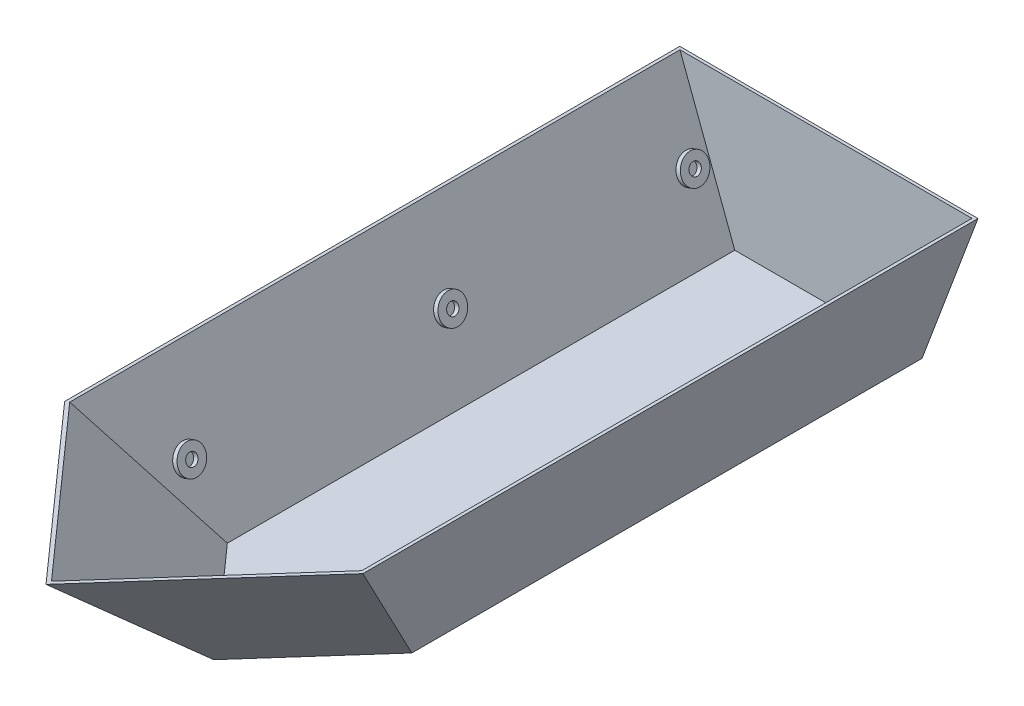
ISO-10303-21;
HEADER;
FILE_DESCRIPTION(('STEP AP214'),'2;1');
FILE_NAME('part.step','',(''),(''),'','','');
FILE_SCHEMA(('AUTOMOTIVE_DESIGN { 1 0 10303 214 1 1 1 1 }'));
ENDSEC;
DATA;
#1=APPLICATION_CONTEXT('core data for automotive mechanical design processes');
#2=APPLICATION_PROTOCOL_DEFINITION('international standard','automotive_design',2000,#1);
#3=PRODUCT_CONTEXT('',#1,'mechanical');
#4=PRODUCT('Part','Part','',(#3));
#5=PRODUCT_RELATED_PRODUCT_CATEGORY('part','',(#4));
#6=PRODUCT_DEFINITION_FORMATION('','',#4);
#7=PRODUCT_DEFINITION_CONTEXT('part definition',#1,'design');
#8=PRODUCT_DEFINITION('design','',#6,#7);
#9=PRODUCT_DEFINITION_SHAPE('','',#8);
#10=(LENGTH_UNIT() NAMED_UNIT(*) SI_UNIT(.MILLI.,.METRE.));
#11=(NAMED_UNIT(*) PLANE_ANGLE_UNIT() SI_UNIT($,.RADIAN.));
#12=(NAMED_UNIT(*) SI_UNIT($,.STERADIAN.) SOLID_ANGLE_UNIT());
#13=UNCERTAINTY_MEASURE_WITH_UNIT(LENGTH_MEASURE(1.E-05),#10,'distance_accuracy_value','');
#14=(GEOMETRIC_REPRESENTATION_CONTEXT(3) GLOBAL_UNCERTAINTY_ASSIGNED_CONTEXT((#13)) GLOBAL_UNIT_ASSIGNED_CONTEXT((#10,
#11,#12)) REPRESENTATION_CONTEXT('',''));
#15=CARTESIAN_POINT('',(0.,0.,0.));
#16=DIRECTION('',(0.,0.,1.));
#17=DIRECTION('',(1.,0.,0.));
#18=AXIS2_PLACEMENT_3D('',#15,#16,#17);
#19=CARTESIAN_POINT('',(660.4,406.4,2133.6));
#20=DIRECTION('',(0.,-1.,0.));
#21=DIRECTION('',(0.,0.,-1.));
#22=AXIS2_PLACEMENT_3D('',#19,#20,#21);
#23=PLANE('',#22);
#24=DIRECTION('',(0.66436383882992,0.,0.74740931868366));
#25=VECTOR('',#24,1.);
#26=CARTESIAN_POINT('',(-1501.75378137035,406.4,158.376995958358));
#27=LINE('',#26,#25);
#28=CARTESIAN_POINT('',(-152.4,406.4,1676.4));
#29=VERTEX_POINT('',#28);
#30=CARTESIAN_POINT('',(253.999999999999,406.4,2133.6));
#31=VERTEX_POINT('',#30);
#32=EDGE_CURVE('E170',#29,#31,#27,.T.);
#33=ORIENTED_EDGE('',*,*,#32,.T.);
#34=DIRECTION('',(-0.66436383882992,0.,0.74740931868366));
#35=VECTOR('',#34,1.);
#36=CARTESIAN_POINT('',(2009.75378137035,406.4,158.376995958358));
#37=LINE('',#36,#35);
#38=CARTESIAN_POINT('',(660.4,406.4,1676.4));
#39=VERTEX_POINT('',#38);
#40=EDGE_CURVE('E137',#39,#31,#37,.T.);
#41=ORIENTED_EDGE('',*,*,#40,.F.);
#42=DIRECTION('',(0.,0.,-1.));
#43=VECTOR('',#42,1.);
#44=CARTESIAN_POINT('',(660.4,406.4,2133.6));
#45=LINE('',#44,#43);
#46=CARTESIAN_POINT('',(660.4,406.4,0.));
#47=VERTEX_POINT('',#46);
#48=EDGE_CURVE('E186',#39,#47,#45,.T.);
#49=ORIENTED_EDGE('',*,*,#48,.T.);
#50=DIRECTION('',(-1.,0.,0.));
#51=VECTOR('',#50,1.);
#52=CARTESIAN_POINT('',(660.4,406.4,0.));
#53=LINE('',#52,#51);
#54=CARTESIAN_POINT('',(-152.4,406.4,0.));
#55=VERTEX_POINT('',#54);
#56=EDGE_CURVE('E183',#47,#55,#53,.T.);
#57=ORIENTED_EDGE('',*,*,#56,.T.);
#58=DIRECTION('',(0.,0.,-1.));
#59=VECTOR('',#58,1.);
#60=CARTESIAN_POINT('',(-152.4,406.4,2133.6));
#61=LINE('',#60,#59);
#62=EDGE_CURVE('E57',#29,#55,#61,.T.);
#63=ORIENTED_EDGE('',*,*,#62,.F.);
#64=EDGE_LOOP('',(#33,#41,#49,#57,#63));
#65=FACE_BOUND('',#64,.T.);
#66=DIRECTION('',(0.66436383882992,0.,0.74740931868366));
#67=VECTOR('',#66,1.);
#68=CARTESIAN_POINT('',(-1494.34729095635,406.4,151.793448923691));
#69=LINE('',#68,#67);
#70=CARTESIAN_POINT('',(-143.922746283943,406.4,1671.02106168015));
#71=VERTEX_POINT('',#70);
#72=CARTESIAN_POINT('',(254.,406.4,2118.68415124958));
#73=VERTEX_POINT('',#72);
#74=EDGE_CURVE('E122',#71,#73,#69,.T.);
#75=ORIENTED_EDGE('',*,*,#74,.F.);
#76=DIRECTION('',(0.,0.,-1.));
#77=VECTOR('',#76,1.);
#78=CARTESIAN_POINT('',(-143.922746283943,406.4,2133.6));
#79=LINE('',#78,#77);
#80=CARTESIAN_POINT('',(-143.922746283943,406.4,7.9375));
#81=VERTEX_POINT('',#80);
#82=EDGE_CURVE('E118',#71,#81,#79,.T.);
#83=ORIENTED_EDGE('',*,*,#82,.T.);
#84=DIRECTION('',(-1.,0.,0.));
#85=VECTOR('',#84,1.);
#86=CARTESIAN_POINT('',(660.4,406.4,7.93750000000015));
#87=LINE('',#86,#85);
#88=CARTESIAN_POINT('',(651.922746283943,406.4,7.9375));
#89=VERTEX_POINT('',#88);
#90=EDGE_CURVE('E151',#89,#81,#87,.T.);
#91=ORIENTED_EDGE('',*,*,#90,.F.);
#92=DIRECTION('',(0.,0.,-1.));
#93=VECTOR('',#92,1.);
#94=CARTESIAN_POINT('',(651.922746283943,406.4,2133.6));
#95=LINE('',#94,#93);
#96=CARTESIAN_POINT('',(651.922746283943,406.4,1671.02106168015));
#97=VERTEX_POINT('',#96);
#98=EDGE_CURVE('E139',#97,#89,#95,.T.);
#99=ORIENTED_EDGE('',*,*,#98,.F.);
#100=DIRECTION('',(-0.66436383882992,0.,0.74740931868366));
#101=VECTOR('',#100,1.);
#102=CARTESIAN_POINT('',(2002.34729095635,406.4,151.793448923691));
#103=LINE('',#102,#101);
#104=EDGE_CURVE('E144',#97,#73,#103,.T.);
#105=ORIENTED_EDGE('',*,*,#104,.T.);
#106=EDGE_LOOP('',(#75,#83,#91,#99,#105));
#107=FACE_BOUND('',#106,.T.);
#108=ADVANCED_FACE('F34',(#65,#107),#23,.F.);
#109=CARTESIAN_POINT('',(-152.4,406.4,2133.6));
#110=DIRECTION('',(0.936329177569045,0.351123441588392,0.));
#111=DIRECTION('',(-0.351123441588392,0.936329177569045,0.));
#112=AXIS2_PLACEMENT_3D('',#109,#110,#111);
#113=PLANE('',#112);
#114=DIRECTION('',(0.293272331791282,-0.78205955144342,-0.549885622108654));
#115=VECTOR('',#114,1.);
#116=CARTESIAN_POINT('',(-226.13092429446,603.015798118561,1814.64548305211));
#117=LINE('',#116,#115);
#118=CARTESIAN_POINT('',(2.22044604925031E-13,0.,1390.65));
#119=VERTEX_POINT('',#118);
#120=EDGE_CURVE('E173',#29,#119,#117,.T.);
#121=ORIENTED_EDGE('',*,*,#120,.F.);
#122=ORIENTED_EDGE('',*,*,#62,.T.);
#123=DIRECTION('',(0.351123441588392,-0.936329177569045,0.));
#124=VECTOR('',#123,1.);
#125=CARTESIAN_POINT('',(-152.4,406.4,0.));
#126=LINE('',#125,#124);
#127=CARTESIAN_POINT('',(0.,0.,0.));
#128=VERTEX_POINT('',#127);
#129=EDGE_CURVE('E175',#55,#128,#126,.T.);
#130=ORIENTED_EDGE('',*,*,#129,.T.);
#131=DIRECTION('',(0.,0.,-1.));
#132=VECTOR('',#131,1.);
#133=CARTESIAN_POINT('',(0.,0.,2133.6));
#134=LINE('',#133,#132);
#135=EDGE_CURVE('E190',#119,#128,#134,.T.);
#136=ORIENTED_EDGE('',*,*,#135,.F.);
#137=EDGE_LOOP('',(#121,#122,#130,#136));
#138=FACE_BOUND('',#137,.T.);
#139=ADVANCED_FACE('F36',(#138),#113,.F.);
#140=CARTESIAN_POINT('',(0.,0.,2133.6));
#141=DIRECTION('',(0.,1.,0.));
#142=DIRECTION('',(0.,0.,1.));
#143=AXIS2_PLACEMENT_3D('',#140,#141,#142);
#144=PLANE('',#143);
#145=DIRECTION('',(0.,0.,-1.));
#146=VECTOR('',#145,1.);
#147=CARTESIAN_POINT('',(508.,0.,2133.6));
#148=LINE('',#147,#146);
#149=CARTESIAN_POINT('',(508.,0.,1390.65));
#150=VERTEX_POINT('',#149);
#151=CARTESIAN_POINT('',(508.,0.,0.));
#152=VERTEX_POINT('',#151);
#153=EDGE_CURVE('E188',#150,#152,#148,.T.);
#154=ORIENTED_EDGE('',*,*,#153,.F.);
#155=DIRECTION('',(-0.66436383882992,0.,0.74740931868366));
#156=VECTOR('',#155,1.);
#157=CARTESIAN_POINT('',(2009.75378137035,0.,-298.823004041642));
#158=LINE('',#157,#156);
#159=CARTESIAN_POINT('',(254.,0.,1676.4));
#160=VERTEX_POINT('',#159);
#161=EDGE_CURVE('E161',#150,#160,#158,.T.);
#162=ORIENTED_EDGE('',*,*,#161,.T.);
#163=DIRECTION('',(0.66436383882992,0.,0.74740931868366));
#164=VECTOR('',#163,1.);
#165=CARTESIAN_POINT('',(-1501.75378137035,0.,-298.823004041642));
#166=LINE('',#165,#164);
#167=EDGE_CURVE('E167',#119,#160,#166,.T.);
#168=ORIENTED_EDGE('',*,*,#167,.F.);
#169=ORIENTED_EDGE('',*,*,#135,.T.);
#170=DIRECTION('',(1.,0.,0.));
#171=VECTOR('',#170,1.);
#172=CARTESIAN_POINT('',(0.,0.,0.));
#173=LINE('',#172,#171);
#174=EDGE_CURVE('E177',#128,#152,#173,.T.);
#175=ORIENTED_EDGE('',*,*,#174,.T.);
#176=EDGE_LOOP('',(#154,#162,#168,#169,#175));
#177=FACE_BOUND('',#176,.T.);
#178=ADVANCED_FACE('F246',(#177),#144,.F.);
#179=CARTESIAN_POINT('',(508.,0.,2133.6));
#180=DIRECTION('',(-0.936329177569045,0.351123441588392,0.));
#181=DIRECTION('',(-0.351123441588392,-0.936329177569045,0.));
#182=AXIS2_PLACEMENT_3D('',#179,#180,#181);
#183=PLANE('',#182);
#184=ORIENTED_EDGE('',*,*,#48,.F.);
#185=DIRECTION('',(-0.293272331791282,-0.78205955144342,-0.549885622108654));
#186=VECTOR('',#185,1.);
#187=CARTESIAN_POINT('',(627.812751978498,319.500671942661,1615.29890995968));
#188=LINE('',#187,#186);
#189=EDGE_CURVE('E164',#39,#150,#188,.T.);
#190=ORIENTED_EDGE('',*,*,#189,.T.);
#191=ORIENTED_EDGE('',*,*,#153,.T.);
#192=DIRECTION('',(0.351123441588392,0.936329177569045,0.));
#193=VECTOR('',#192,1.);
#194=CARTESIAN_POINT('',(508.,0.,0.));
#195=LINE('',#194,#193);
#196=EDGE_CURVE('E180',#152,#47,#195,.T.);
#197=ORIENTED_EDGE('',*,*,#196,.T.);
#198=EDGE_LOOP('',(#184,#190,#191,#197));
#199=FACE_BOUND('',#198,.T.);
#200=ADVANCED_FACE('F252',(#199),#183,.F.);
#201=CARTESIAN_POINT('',(0.,0.,0.));
#202=DIRECTION('',(0.,0.,1.));
#203=DIRECTION('',(1.,0.,0.));
#204=AXIS2_PLACEMENT_3D('',#201,#202,#203);
#205=PLANE('',#204);
#206=ORIENTED_EDGE('',*,*,#129,.F.);
#207=ORIENTED_EDGE('',*,*,#56,.F.);
#208=ORIENTED_EDGE('',*,*,#196,.F.);
#209=ORIENTED_EDGE('',*,*,#174,.F.);
#210=EDGE_LOOP('',(#206,#207,#208,#209));
#211=FACE_BOUND('',#210,.T.);
#212=ADVANCED_FACE('F250',(#211),#205,.F.);
#213=CARTESIAN_POINT('',(-1501.75378137035,406.4,158.376995958358));
#214=DIRECTION('',(-0.598671094713965,-0.598671094713965,0.532152084190192));
#215=DIRECTION('',(0.707106781186547,-0.707106781186548,0.));
#216=AXIS2_PLACEMENT_3D('',#213,#214,#215);
#217=PLANE('',#216);
#218=DIRECTION('',(0.,-0.66436383882992,-0.747409318683659));
#219=VECTOR('',#218,1.);
#220=CARTESIAN_POINT('',(254.,-574.400388213781,1030.1995632595));
#221=LINE('',#220,#219);
#222=EDGE_CURVE('E192',#31,#160,#221,.T.);
#223=ORIENTED_EDGE('',*,*,#222,.F.);
#224=ORIENTED_EDGE('',*,*,#32,.F.);
#225=ORIENTED_EDGE('',*,*,#120,.T.);
#226=ORIENTED_EDGE('',*,*,#167,.T.);
#227=EDGE_LOOP('',(#223,#224,#225,#226));
#228=FACE_BOUND('',#227,.T.);
#229=ADVANCED_FACE('F269',(#228),#217,.T.);
#230=CARTESIAN_POINT('',(2009.75378137035,406.4,158.376995958358));
#231=DIRECTION('',(-0.598671094713965,0.598671094713965,-0.532152084190192));
#232=DIRECTION('',(-0.707106781186547,-0.707106781186548,0.));
#233=AXIS2_PLACEMENT_3D('',#230,#231,#232);
#234=PLANE('',#233);
#235=ORIENTED_EDGE('',*,*,#40,.T.);
#236=ORIENTED_EDGE('',*,*,#222,.T.);
#237=ORIENTED_EDGE('',*,*,#161,.F.);
#238=ORIENTED_EDGE('',*,*,#189,.F.);
#239=EDGE_LOOP('',(#235,#236,#237,#238));
#240=FACE_BOUND('',#239,.T.);
#241=ADVANCED_FACE('F212',(#240),#234,.F.);
#242=CARTESIAN_POINT('',(-144.967887153046,409.187042317608,2133.6));
#243=DIRECTION('',(0.936329177569045,0.351123441588392,0.));
#244=DIRECTION('',(-0.351123441588392,0.936329177569045,0.));
#245=AXIS2_PLACEMENT_3D('',#242,#243,#244);
#246=PLANE('',#245);
#247=CARTESIAN_POINT('',(-63.6559275368364,192.355150007716,1430.3375));
#248=DIRECTION('',(0.936329177569045,0.351123441588392,0.));
#249=DIRECTION('',(-0.351123441588392,0.936329177569045,0.));
#250=AXIS2_PLACEMENT_3D('',#247,#248,#249);
#251=CIRCLE('',#250,38.1000000000001);
#252=CARTESIAN_POINT('',(-77.0337306613541,228.029291673097,1430.3375));
#253=VERTEX_POINT('',#252);
#254=EDGE_CURVE('E11',#253,#253,#251,.T.);
#255=ORIENTED_EDGE('',*,*,#254,.F.);
#256=EDGE_LOOP('',(#255));
#257=FACE_BOUND('',#256,.T.);
#258=CARTESIAN_POINT('',(-63.6559275368364,192.355150007716,719.1375));
#259=DIRECTION('',(0.936329177569045,0.351123441588392,0.));
#260=DIRECTION('',(-0.351123441588392,0.936329177569045,0.));
#261=AXIS2_PLACEMENT_3D('',#258,#259,#260);
#262=CIRCLE('',#261,38.1);
#263=CARTESIAN_POINT('',(-77.0337306613541,228.029291673097,719.1375));
#264=VERTEX_POINT('',#263);
#265=EDGE_CURVE('E42',#264,#264,#262,.T.);
#266=ORIENTED_EDGE('',*,*,#265,.F.);
#267=EDGE_LOOP('',(#266));
#268=FACE_BOUND('',#267,.T.);
#269=CARTESIAN_POINT('',(-63.6559275368364,192.355150007716,58.7375));
#270=DIRECTION('',(0.936329177569045,0.351123441588392,0.));
#271=DIRECTION('',(-0.351123441588392,0.936329177569045,0.));
#272=AXIS2_PLACEMENT_3D('',#269,#270,#271);
#273=CIRCLE('',#272,38.1);
#274=CARTESIAN_POINT('',(-77.0337306613541,228.029291673097,58.7375));
#275=VERTEX_POINT('',#274);
#276=EDGE_CURVE('E203',#275,#275,#273,.T.);
#277=ORIENTED_EDGE('',*,*,#276,.F.);
#278=EDGE_LOOP('',(#277));
#279=FACE_BOUND('',#278,.T.);
#280=DIRECTION('',(0.293272331791282,-0.78205955144342,-0.549885622108654));
#281=VECTOR('',#280,1.);
#282=CARTESIAN_POINT('',(-219.25022896662,607.273287153806,1812.26009171017));
#283=LINE('',#282,#281);
#284=CARTESIAN_POINT('',(5.50069121605727,7.9375,1390.85211636765));
#285=VERTEX_POINT('',#284);
#286=EDGE_CURVE('E111',#71,#285,#283,.T.);
#287=ORIENTED_EDGE('',*,*,#286,.T.);
#288=DIRECTION('',(0.,0.,-1.));
#289=VECTOR('',#288,1.);
#290=CARTESIAN_POINT('',(5.50069121605727,7.9375,2133.6));
#291=LINE('',#290,#289);
#292=CARTESIAN_POINT('',(5.50069121605725,7.9375,7.9375));
#293=VERTEX_POINT('',#292);
#294=EDGE_CURVE('E115',#285,#293,#291,.T.);
#295=ORIENTED_EDGE('',*,*,#294,.T.);
#296=DIRECTION('',(0.351123441588392,-0.936329177569045,0.));
#297=VECTOR('',#296,1.);
#298=CARTESIAN_POINT('',(-144.967887153046,409.187042317608,7.93750000000015));
#299=LINE('',#298,#297);
#300=EDGE_CURVE('E49',#81,#293,#299,.T.);
#301=ORIENTED_EDGE('',*,*,#300,.F.);
#302=ORIENTED_EDGE('',*,*,#82,.F.);
#303=EDGE_LOOP('',(#287,#295,#301,#302));
#304=FACE_BOUND('',#303,.T.);
#305=ADVANCED_FACE('F113',(#257,#268,#279,#304),#246,.T.);
#306=CARTESIAN_POINT('',(0.,7.9375,2133.6));
#307=DIRECTION('',(0.,1.,0.));
#308=DIRECTION('',(0.,0.,1.));
#309=AXIS2_PLACEMENT_3D('',#306,#307,#308);
#310=PLANE('',#309);
#311=DIRECTION('',(0.,0.,-1.));
#312=VECTOR('',#311,1.);
#313=CARTESIAN_POINT('',(502.499308783943,7.9375,2133.6));
#314=LINE('',#313,#312);
#315=CARTESIAN_POINT('',(502.499308783943,7.9375,1390.85211636765));
#316=VERTEX_POINT('',#315);
#317=CARTESIAN_POINT('',(502.499308783943,7.9375,7.9375));
#318=VERTEX_POINT('',#317);
#319=EDGE_CURVE('E135',#316,#318,#314,.T.);
#320=ORIENTED_EDGE('',*,*,#319,.T.);
#321=DIRECTION('',(1.,0.,0.));
#322=VECTOR('',#321,1.);
#323=CARTESIAN_POINT('',(0.,7.9375,7.93750000000015));
#324=LINE('',#323,#322);
#325=EDGE_CURVE('E134',#293,#318,#324,.T.);
#326=ORIENTED_EDGE('',*,*,#325,.F.);
#327=ORIENTED_EDGE('',*,*,#294,.F.);
#328=DIRECTION('',(0.66436383882992,0.,0.74740931868366));
#329=VECTOR('',#328,1.);
#330=CARTESIAN_POINT('',(371.885542138138,7.9375,1803.03507365499));
#331=LINE('',#330,#329);
#332=CARTESIAN_POINT('',(254.,7.9375,1670.41383874958));
#333=VERTEX_POINT('',#332);
#334=EDGE_CURVE('E125',#285,#333,#331,.T.);
#335=ORIENTED_EDGE('',*,*,#334,.T.);
#336=DIRECTION('',(-0.66436383882992,0.,0.74740931868366));
#337=VECTOR('',#336,1.);
#338=CARTESIAN_POINT('',(-88.1062317933104,7.9375,2055.28334951706));
#339=LINE('',#338,#337);
#340=EDGE_CURVE('E143',#316,#333,#339,.T.);
#341=ORIENTED_EDGE('',*,*,#340,.F.);
#342=EDGE_LOOP('',(#320,#326,#327,#335,#341));
#343=FACE_BOUND('',#342,.T.);
#344=ADVANCED_FACE('F132',(#343),#310,.T.);
#345=CARTESIAN_POINT('',(500.567887153046,2.78704231760786,2133.6));
#346=DIRECTION('',(-0.936329177569045,0.351123441588392,0.));
#347=DIRECTION('',(-0.351123441588392,-0.936329177569045,0.));
#348=AXIS2_PLACEMENT_3D('',#345,#346,#347);
#349=PLANE('',#348);
#350=CARTESIAN_POINT('',(571.655927536836,192.355150007716,1430.3375));
#351=DIRECTION('',(-0.936329177569045,0.351123441588392,0.));
#352=DIRECTION('',(-0.351123441588392,-0.936329177569045,0.));
#353=AXIS2_PLACEMENT_3D('',#350,#351,#352);
#354=CIRCLE('',#353,38.1000000000001);
#355=CARTESIAN_POINT('',(558.278124412318,156.681008342336,1430.3375));
#356=VERTEX_POINT('',#355);
#357=EDGE_CURVE('E337',#356,#356,#354,.T.);
#358=ORIENTED_EDGE('',*,*,#357,.F.);
#359=EDGE_LOOP('',(#358));
#360=FACE_BOUND('',#359,.T.);
#361=CARTESIAN_POINT('',(571.655927536836,192.355150007716,719.1375));
#362=DIRECTION('',(-0.936329177569045,0.351123441588392,0.));
#363=DIRECTION('',(-0.351123441588392,-0.936329177569045,0.));
#364=AXIS2_PLACEMENT_3D('',#361,#362,#363);
#365=CIRCLE('',#364,38.1);
#366=CARTESIAN_POINT('',(558.278124412318,156.681008342336,719.1375));
#367=VERTEX_POINT('',#366);
#368=EDGE_CURVE('E352',#367,#367,#365,.T.);
#369=ORIENTED_EDGE('',*,*,#368,.F.);
#370=EDGE_LOOP('',(#369));
#371=FACE_BOUND('',#370,.T.);
#372=CARTESIAN_POINT('',(571.655927536836,192.355150007716,58.7375));
#373=DIRECTION('',(-0.936329177569045,0.351123441588392,0.));
#374=DIRECTION('',(-0.351123441588392,-0.936329177569045,0.));
#375=AXIS2_PLACEMENT_3D('',#372,#373,#374);
#376=CIRCLE('',#375,38.1);
#377=CARTESIAN_POINT('',(558.278124412318,156.681008342336,58.7375));
#378=VERTEX_POINT('',#377);
#379=EDGE_CURVE('E361',#378,#378,#376,.T.);
#380=ORIENTED_EDGE('',*,*,#379,.F.);
#381=EDGE_LOOP('',(#380));
#382=FACE_BOUND('',#381,.T.);
#383=ORIENTED_EDGE('',*,*,#98,.T.);
#384=DIRECTION('',(0.351123441588392,0.936329177569045,0.));
#385=VECTOR('',#384,1.);
#386=CARTESIAN_POINT('',(500.567887153046,2.78704231760786,7.93750000000015));
#387=LINE('',#386,#385);
#388=EDGE_CURVE('E147',#318,#89,#387,.T.);
#389=ORIENTED_EDGE('',*,*,#388,.F.);
#390=ORIENTED_EDGE('',*,*,#319,.F.);
#391=DIRECTION('',(-0.293272331791282,-0.78205955144342,-0.549885622108654));
#392=VECTOR('',#391,1.);
#393=CARTESIAN_POINT('',(620.932056650658,323.758160977906,1612.91351861774));
#394=LINE('',#393,#392);
#395=EDGE_CURVE('E130',#97,#316,#394,.T.);
#396=ORIENTED_EDGE('',*,*,#395,.F.);
#397=EDGE_LOOP('',(#383,#389,#390,#396));
#398=FACE_BOUND('',#397,.T.);
#399=ADVANCED_FACE('F237',(#360,#371,#382,#398),#349,.T.);
#400=CARTESIAN_POINT('',(0.,0.,7.9375));
#401=DIRECTION('',(0.,0.,1.));
#402=DIRECTION('',(1.,0.,0.));
#403=AXIS2_PLACEMENT_3D('',#400,#401,#402);
#404=PLANE('',#403);
#405=ORIENTED_EDGE('',*,*,#300,.T.);
#406=ORIENTED_EDGE('',*,*,#325,.T.);
#407=ORIENTED_EDGE('',*,*,#388,.T.);
#408=ORIENTED_EDGE('',*,*,#90,.T.);
#409=EDGE_LOOP('',(#405,#406,#407,#408));
#410=FACE_BOUND('',#409,.T.);
#411=ADVANCED_FACE('F289',(#410),#404,.T.);
#412=CARTESIAN_POINT('',(-1497.00182955606,411.151951814292,154.153038790098));
#413=DIRECTION('',(-0.598671094713965,-0.598671094713965,0.532152084190192));
#414=DIRECTION('',(0.707106781186547,-0.707106781186548,0.));
#415=AXIS2_PLACEMENT_3D('',#412,#413,#414);
#416=PLANE('',#415);
#417=DIRECTION('',(0.,-0.66436383882992,-0.747409318683659));
#418=VECTOR('',#417,1.);
#419=CARTESIAN_POINT('',(254.,-566.993897799781,1023.61601622483));
#420=LINE('',#419,#418);
#421=EDGE_CURVE('E127',#73,#333,#420,.T.);
#422=ORIENTED_EDGE('',*,*,#421,.T.);
#423=ORIENTED_EDGE('',*,*,#334,.F.);
#424=ORIENTED_EDGE('',*,*,#286,.F.);
#425=ORIENTED_EDGE('',*,*,#74,.T.);
#426=EDGE_LOOP('',(#422,#423,#424,#425));
#427=FACE_BOUND('',#426,.T.);
#428=ADVANCED_FACE('F126',(#427),#416,.F.);
#429=CARTESIAN_POINT('',(2005.00182955606,411.151951814292,154.153038790098));
#430=DIRECTION('',(-0.598671094713965,0.598671094713965,-0.532152084190192));
#431=DIRECTION('',(-0.707106781186547,-0.707106781186548,0.));
#432=AXIS2_PLACEMENT_3D('',#429,#430,#431);
#433=PLANE('',#432);
#434=ORIENTED_EDGE('',*,*,#104,.F.);
#435=ORIENTED_EDGE('',*,*,#395,.T.);
#436=ORIENTED_EDGE('',*,*,#340,.T.);
#437=ORIENTED_EDGE('',*,*,#421,.F.);
#438=EDGE_LOOP('',(#434,#435,#436,#437));
#439=FACE_BOUND('',#438,.T.);
#440=ADVANCED_FACE('F282',(#439),#433,.T.);
#441=CARTESIAN_POINT('',(559.764546981709,196.814417715889,58.7375));
#442=DIRECTION('',(-0.936329177569045,0.351123441588392,0.));
#443=DIRECTION('',(-0.351123441588392,-0.936329177569045,0.));
#444=AXIS2_PLACEMENT_3D('',#441,#442,#443);
#445=PLANE('',#444);
#446=CARTESIAN_POINT('',(559.764546981709,196.814417715889,58.7375));
#447=DIRECTION('',(-0.936329177569045,0.351123441588392,0.));
#448=DIRECTION('',(-0.351123441588392,-0.936329177569045,0.));
#449=AXIS2_PLACEMENT_3D('',#446,#447,#448);
#450=CIRCLE('',#449,38.1);
#451=CARTESIAN_POINT('',(546.386743857192,161.140276050508,58.7375));
#452=VERTEX_POINT('',#451);
#453=EDGE_CURVE('E157',#452,#452,#450,.T.);
#454=ORIENTED_EDGE('',*,*,#453,.T.);
#455=EDGE_LOOP('',(#454));
#456=FACE_BOUND('',#455,.T.);
#457=CARTESIAN_POINT('',(559.764546981709,196.814417715889,58.7375));
#458=DIRECTION('',(-0.936329177569045,0.351123441588392,0.));
#459=DIRECTION('',(-0.351123441588392,-0.936329177569045,0.));
#460=AXIS2_PLACEMENT_3D('',#457,#458,#459);
#461=CIRCLE('',#460,15.875);
#462=CARTESIAN_POINT('',(554.190462346494,181.95019202198,58.7375));
#463=VERTEX_POINT('',#462);
#464=EDGE_CURVE('E356',#463,#463,#461,.T.);
#465=ORIENTED_EDGE('',*,*,#464,.F.);
#466=EDGE_LOOP('',(#465));
#467=FACE_BOUND('',#466,.T.);
#468=ADVANCED_FACE('F285',(#456,#467),#445,.T.);
#469=CARTESIAN_POINT('',(559.764546981709,196.814417715889,58.7375));
#470=DIRECTION('',(0.936329177569044,-0.351123441588392,0.));
#471=DIRECTION('',(0.351123441588392,0.936329177569045,0.));
#472=AXIS2_PLACEMENT_3D('',#469,#470,#471);
#473=CYLINDRICAL_SURFACE('',#472,38.1);
#474=ORIENTED_EDGE('',*,*,#453,.F.);
#475=EDGE_LOOP('',(#474));
#476=FACE_BOUND('',#475,.T.);
#477=ORIENTED_EDGE('',*,*,#379,.T.);
#478=EDGE_LOOP('',(#477));
#479=FACE_BOUND('',#478,.T.);
#480=ADVANCED_FACE('F298',(#476,#479),#473,.T.);
#481=CARTESIAN_POINT('',(559.764546981709,196.814417715889,58.7375));
#482=DIRECTION('',(0.936329177569044,-0.351123441588392,0.));
#483=DIRECTION('',(0.351123441588392,0.936329177569045,0.));
#484=AXIS2_PLACEMENT_3D('',#481,#482,#483);
#485=CYLINDRICAL_SURFACE('',#484,15.875);
#486=ORIENTED_EDGE('',*,*,#464,.T.);
#487=EDGE_LOOP('',(#486));
#488=FACE_BOUND('',#487,.T.);
#489=CARTESIAN_POINT('',(571.655927536836,192.355150007716,58.7375));
#490=DIRECTION('',(-0.936329177569045,0.351123441588392,0.));
#491=DIRECTION('',(-0.351123441588392,-0.936329177569045,0.));
#492=AXIS2_PLACEMENT_3D('',#489,#490,#491);
#493=CIRCLE('',#492,15.875);
#494=CARTESIAN_POINT('',(566.081842901621,177.490924313808,58.7375));
#495=VERTEX_POINT('',#494);
#496=EDGE_CURVE('E194',#495,#495,#493,.F.);
#497=ORIENTED_EDGE('',*,*,#496,.T.);
#498=EDGE_LOOP('',(#497));
#499=FACE_BOUND('',#498,.T.);
#500=ADVANCED_FACE('F301',(#488,#499),#485,.F.);
#501=ORIENTED_EDGE('',*,*,#496,.F.);
#502=EDGE_LOOP('',(#501));
#503=FACE_BOUND('',#502,.T.);
#504=ADVANCED_FACE('F295',(#503),#349,.T.);
#505=CARTESIAN_POINT('',(559.764546981709,196.814417715889,719.1375));
#506=DIRECTION('',(-0.936329177569045,0.351123441588392,0.));
#507=DIRECTION('',(-0.351123441588392,-0.936329177569045,0.));
#508=AXIS2_PLACEMENT_3D('',#505,#506,#507);
#509=PLANE('',#508);
#510=CARTESIAN_POINT('',(559.764546981709,196.814417715889,719.1375));
#511=DIRECTION('',(-0.936329177569045,0.351123441588392,0.));
#512=DIRECTION('',(-0.351123441588392,-0.936329177569045,0.));
#513=AXIS2_PLACEMENT_3D('',#510,#511,#512);
#514=CIRCLE('',#513,38.1);
#515=CARTESIAN_POINT('',(546.386743857192,161.140276050508,719.1375));
#516=VERTEX_POINT('',#515);
#517=EDGE_CURVE('E353',#516,#516,#514,.T.);
#518=ORIENTED_EDGE('',*,*,#517,.T.);
#519=EDGE_LOOP('',(#518));
#520=FACE_BOUND('',#519,.T.);
#521=CARTESIAN_POINT('',(559.764546981709,196.814417715889,719.1375));
#522=DIRECTION('',(-0.936329177569045,0.351123441588392,0.));
#523=DIRECTION('',(-0.351123441588392,-0.936329177569045,0.));
#524=AXIS2_PLACEMENT_3D('',#521,#522,#523);
#525=CIRCLE('',#524,15.875);
#526=CARTESIAN_POINT('',(554.190462346494,181.95019202198,719.1375));
#527=VERTEX_POINT('',#526);
#528=EDGE_CURVE('E348',#527,#527,#525,.T.);
#529=ORIENTED_EDGE('',*,*,#528,.F.);
#530=EDGE_LOOP('',(#529));
#531=FACE_BOUND('',#530,.T.);
#532=ADVANCED_FACE('F313',(#520,#531),#509,.T.);
#533=CARTESIAN_POINT('',(559.764546981709,196.814417715889,719.1375));
#534=DIRECTION('',(0.936329177569044,-0.351123441588392,0.));
#535=DIRECTION('',(0.351123441588392,0.936329177569045,0.));
#536=AXIS2_PLACEMENT_3D('',#533,#534,#535);
#537=CYLINDRICAL_SURFACE('',#536,38.1);
#538=ORIENTED_EDGE('',*,*,#517,.F.);
#539=EDGE_LOOP('',(#538));
#540=FACE_BOUND('',#539,.T.);
#541=ORIENTED_EDGE('',*,*,#368,.T.);
#542=EDGE_LOOP('',(#541));
#543=FACE_BOUND('',#542,.T.);
#544=ADVANCED_FACE('F309',(#540,#543),#537,.T.);
#545=CARTESIAN_POINT('',(559.764546981709,196.814417715889,719.1375));
#546=DIRECTION('',(0.936329177569044,-0.351123441588392,0.));
#547=DIRECTION('',(0.351123441588392,0.936329177569045,0.));
#548=AXIS2_PLACEMENT_3D('',#545,#546,#547);
#549=CYLINDRICAL_SURFACE('',#548,15.875);
#550=ORIENTED_EDGE('',*,*,#528,.T.);
#551=EDGE_LOOP('',(#550));
#552=FACE_BOUND('',#551,.T.);
#553=CARTESIAN_POINT('',(571.655927536836,192.355150007716,719.1375));
#554=DIRECTION('',(-0.936329177569045,0.351123441588392,0.));
#555=DIRECTION('',(-0.351123441588392,-0.936329177569045,0.));
#556=AXIS2_PLACEMENT_3D('',#553,#554,#555);
#557=CIRCLE('',#556,15.875);
#558=CARTESIAN_POINT('',(566.081842901621,177.490924313808,719.1375));
#559=VERTEX_POINT('',#558);
#560=EDGE_CURVE('E197',#559,#559,#557,.F.);
#561=ORIENTED_EDGE('',*,*,#560,.T.);
#562=EDGE_LOOP('',(#561));
#563=FACE_BOUND('',#562,.T.);
#564=ADVANCED_FACE('F312',(#552,#563),#549,.F.);
#565=ORIENTED_EDGE('',*,*,#560,.F.);
#566=EDGE_LOOP('',(#565));
#567=FACE_BOUND('',#566,.T.);
#568=ADVANCED_FACE('F236',(#567),#349,.T.);
#569=CARTESIAN_POINT('',(559.764546981709,196.814417715889,1430.3375));
#570=DIRECTION('',(-0.936329177569045,0.351123441588392,0.));
#571=DIRECTION('',(-0.351123441588392,-0.936329177569045,0.));
#572=AXIS2_PLACEMENT_3D('',#569,#570,#571);
#573=PLANE('',#572);
#574=CARTESIAN_POINT('',(559.764546981709,196.814417715889,1430.3375));
#575=DIRECTION('',(-0.936329177569045,0.351123441588392,0.));
#576=DIRECTION('',(-0.351123441588392,-0.936329177569045,0.));
#577=AXIS2_PLACEMENT_3D('',#574,#575,#576);
#578=CIRCLE('',#577,38.1000000000001);
#579=CARTESIAN_POINT('',(546.386743857192,161.140276050508,1430.3375));
#580=VERTEX_POINT('',#579);
#581=EDGE_CURVE('E341',#580,#580,#578,.T.);
#582=ORIENTED_EDGE('',*,*,#581,.T.);
#583=EDGE_LOOP('',(#582));
#584=FACE_BOUND('',#583,.T.);
#585=CARTESIAN_POINT('',(559.764546981709,196.814417715889,1430.3375));
#586=DIRECTION('',(-0.936329177569045,0.351123441588392,0.));
#587=DIRECTION('',(-0.351123441588392,-0.936329177569045,0.));
#588=AXIS2_PLACEMENT_3D('',#585,#586,#587);
#589=CIRCLE('',#588,15.8750000000002);
#590=CARTESIAN_POINT('',(554.190462346494,181.95019202198,1430.3375));
#591=VERTEX_POINT('',#590);
#592=EDGE_CURVE('E334',#591,#591,#589,.T.);
#593=ORIENTED_EDGE('',*,*,#592,.F.);
#594=EDGE_LOOP('',(#593));
#595=FACE_BOUND('',#594,.T.);
#596=ADVANCED_FACE('F324',(#584,#595),#573,.T.);
#597=CARTESIAN_POINT('',(559.764546981709,196.814417715889,1430.3375));
#598=DIRECTION('',(0.936329177569044,-0.351123441588392,0.));
#599=DIRECTION('',(0.351123441588392,0.936329177569045,0.));
#600=AXIS2_PLACEMENT_3D('',#597,#598,#599);
#601=CYLINDRICAL_SURFACE('',#600,38.1000000000001);
#602=ORIENTED_EDGE('',*,*,#581,.F.);
#603=EDGE_LOOP('',(#602));
#604=FACE_BOUND('',#603,.T.);
#605=ORIENTED_EDGE('',*,*,#357,.T.);
#606=EDGE_LOOP('',(#605));
#607=FACE_BOUND('',#606,.T.);
#608=ADVANCED_FACE('F321',(#604,#607),#601,.T.);
#609=CARTESIAN_POINT('',(559.764546981709,196.814417715889,1430.3375));
#610=DIRECTION('',(0.936329177569044,-0.351123441588392,0.));
#611=DIRECTION('',(0.351123441588392,0.936329177569045,0.));
#612=AXIS2_PLACEMENT_3D('',#609,#610,#611);
#613=CYLINDRICAL_SURFACE('',#612,15.8750000000002);
#614=ORIENTED_EDGE('',*,*,#592,.T.);
#615=EDGE_LOOP('',(#614));
#616=FACE_BOUND('',#615,.T.);
#617=CARTESIAN_POINT('',(571.655927536836,192.355150007716,1430.3375));
#618=DIRECTION('',(-0.936329177569045,0.351123441588392,0.));
#619=DIRECTION('',(-0.351123441588392,-0.936329177569045,0.));
#620=AXIS2_PLACEMENT_3D('',#617,#618,#619);
#621=CIRCLE('',#620,15.8750000000002);
#622=CARTESIAN_POINT('',(566.081842901621,177.490924313808,1430.3375));
#623=VERTEX_POINT('',#622);
#624=EDGE_CURVE('E200',#623,#623,#621,.F.);
#625=ORIENTED_EDGE('',*,*,#624,.T.);
#626=EDGE_LOOP('',(#625));
#627=FACE_BOUND('',#626,.T.);
#628=ADVANCED_FACE('F233',(#616,#627),#613,.F.);
#629=ORIENTED_EDGE('',*,*,#624,.F.);
#630=EDGE_LOOP('',(#629));
#631=FACE_BOUND('',#630,.T.);
#632=ADVANCED_FACE('F222',(#631),#349,.T.);
#633=CARTESIAN_POINT('',(-51.7645469817094,196.814417715889,58.7375));
#634=DIRECTION('',(-0.936329177569044,-0.351123441588392,0.));
#635=DIRECTION('',(0.351123441588392,-0.936329177569045,0.));
#636=AXIS2_PLACEMENT_3D('',#633,#634,#635);
#637=CYLINDRICAL_SURFACE('',#636,38.1);
#638=CARTESIAN_POINT('',(-51.7645469817094,196.814417715889,58.7375));
#639=DIRECTION('',(-0.936329177569045,-0.351123441588392,0.));
#640=DIRECTION('',(0.351123441588392,-0.936329177569045,0.));
#641=AXIS2_PLACEMENT_3D('',#638,#639,#640);
#642=CIRCLE('',#641,38.1);
#643=CARTESIAN_POINT('',(-38.3867438571917,161.140276050508,58.7375));
#644=VERTEX_POINT('',#643);
#645=EDGE_CURVE('E338',#644,#644,#642,.T.);
#646=ORIENTED_EDGE('',*,*,#645,.T.);
#647=EDGE_LOOP('',(#646));
#648=FACE_BOUND('',#647,.T.);
#649=ORIENTED_EDGE('',*,*,#276,.T.);
#650=EDGE_LOOP('',(#649));
#651=FACE_BOUND('',#650,.T.);
#652=ADVANCED_FACE('F219',(#648,#651),#637,.T.);
#653=CARTESIAN_POINT('',(-51.7645469817094,196.814417715889,58.7375));
#654=DIRECTION('',(0.936329177569045,0.351123441588392,0.));
#655=DIRECTION('',(0.351123441588392,-0.936329177569045,0.));
#656=AXIS2_PLACEMENT_3D('',#653,#654,#655);
#657=PLANE('',#656);
#658=CARTESIAN_POINT('',(-51.7645469817094,196.814417715889,58.7375));
#659=DIRECTION('',(-0.936329177569045,-0.351123441588392,0.));
#660=DIRECTION('',(0.351123441588392,-0.936329177569045,0.));
#661=AXIS2_PLACEMENT_3D('',#658,#659,#660);
#662=CIRCLE('',#661,15.875);
#663=CARTESIAN_POINT('',(-46.1904623464937,181.95019202198,58.7375));
#664=VERTEX_POINT('',#663);
#665=EDGE_CURVE('E343',#664,#664,#662,.T.);
#666=ORIENTED_EDGE('',*,*,#665,.T.);
#667=EDGE_LOOP('',(#666));
#668=FACE_BOUND('',#667,.T.);
#669=ORIENTED_EDGE('',*,*,#645,.F.);
#670=EDGE_LOOP('',(#669));
#671=FACE_BOUND('',#670,.T.);
#672=ADVANCED_FACE('F221',(#668,#671),#657,.T.);
#673=CARTESIAN_POINT('',(-51.7645469817094,196.814417715889,58.7375));
#674=DIRECTION('',(-0.936329177569044,-0.351123441588392,0.));
#675=DIRECTION('',(0.351123441588392,-0.936329177569045,0.));
#676=AXIS2_PLACEMENT_3D('',#673,#674,#675);
#677=CYLINDRICAL_SURFACE('',#676,15.875);
#678=ORIENTED_EDGE('',*,*,#665,.F.);
#679=EDGE_LOOP('',(#678));
#680=FACE_BOUND('',#679,.T.);
#681=CARTESIAN_POINT('',(-63.6559275368362,192.355150007716,58.7375));
#682=DIRECTION('',(-0.936329177569045,-0.351123441588392,0.));
#683=DIRECTION('',(0.351123441588392,-0.936329177569045,0.));
#684=AXIS2_PLACEMENT_3D('',#681,#682,#683);
#685=CIRCLE('',#684,15.875);
#686=CARTESIAN_POINT('',(-58.0818429016205,177.490924313808,58.7375));
#687=VERTEX_POINT('',#686);
#688=EDGE_CURVE('E649',#687,#687,#685,.T.);
#689=ORIENTED_EDGE('',*,*,#688,.T.);
#690=EDGE_LOOP('',(#689));
#691=FACE_BOUND('',#690,.T.);
#692=ADVANCED_FACE('F229',(#680,#691),#677,.F.);
#693=ORIENTED_EDGE('',*,*,#688,.F.);
#694=EDGE_LOOP('',(#693));
#695=FACE_BOUND('',#694,.T.);
#696=ADVANCED_FACE('F216',(#695),#246,.T.);
#697=CARTESIAN_POINT('',(-51.7645469817094,196.814417715889,719.1375));
#698=DIRECTION('',(-0.936329177569044,-0.351123441588392,0.));
#699=DIRECTION('',(0.351123441588392,-0.936329177569045,0.));
#700=AXIS2_PLACEMENT_3D('',#697,#698,#699);
#701=CYLINDRICAL_SURFACE('',#700,38.1);
#702=CARTESIAN_POINT('',(-51.7645469817094,196.814417715889,719.1375));
#703=DIRECTION('',(-0.936329177569045,-0.351123441588392,0.));
#704=DIRECTION('',(0.351123441588392,-0.936329177569045,0.));
#705=AXIS2_PLACEMENT_3D('',#702,#703,#704);
#706=CIRCLE('',#705,38.1);
#707=CARTESIAN_POINT('',(-38.3867438571917,161.140276050508,719.1375));
#708=VERTEX_POINT('',#707);
#709=EDGE_CURVE('E644',#708,#708,#706,.T.);
#710=ORIENTED_EDGE('',*,*,#709,.T.);
#711=EDGE_LOOP('',(#710));
#712=FACE_BOUND('',#711,.T.);
#713=ORIENTED_EDGE('',*,*,#265,.T.);
#714=EDGE_LOOP('',(#713));
#715=FACE_BOUND('',#714,.T.);
#716=ADVANCED_FACE('F208',(#712,#715),#701,.T.);
#717=CARTESIAN_POINT('',(-51.7645469817094,196.814417715889,719.1375));
#718=DIRECTION('',(0.936329177569045,0.351123441588392,0.));
#719=DIRECTION('',(0.351123441588392,-0.936329177569045,0.));
#720=AXIS2_PLACEMENT_3D('',#717,#718,#719);
#721=PLANE('',#720);
#722=CARTESIAN_POINT('',(-51.7645469817094,196.814417715889,719.1375));
#723=DIRECTION('',(-0.936329177569045,-0.351123441588392,0.));
#724=DIRECTION('',(0.351123441588392,-0.936329177569045,0.));
#725=AXIS2_PLACEMENT_3D('',#722,#723,#724);
#726=CIRCLE('',#725,15.875);
#727=CARTESIAN_POINT('',(-46.1904623464937,181.95019202198,719.1375));
#728=VERTEX_POINT('',#727);
#729=EDGE_CURVE('E641',#728,#728,#726,.T.);
#730=ORIENTED_EDGE('',*,*,#729,.T.);
#731=EDGE_LOOP('',(#730));
#732=FACE_BOUND('',#731,.T.);
#733=ORIENTED_EDGE('',*,*,#709,.F.);
#734=EDGE_LOOP('',(#733));
#735=FACE_BOUND('',#734,.T.);
#736=ADVANCED_FACE('F458',(#732,#735),#721,.T.);
#737=CARTESIAN_POINT('',(-51.7645469817094,196.814417715889,719.1375));
#738=DIRECTION('',(-0.936329177569044,-0.351123441588392,0.));
#739=DIRECTION('',(0.351123441588392,-0.936329177569045,0.));
#740=AXIS2_PLACEMENT_3D('',#737,#738,#739);
#741=CYLINDRICAL_SURFACE('',#740,15.875);
#742=ORIENTED_EDGE('',*,*,#729,.F.);
#743=EDGE_LOOP('',(#742));
#744=FACE_BOUND('',#743,.T.);
#745=CARTESIAN_POINT('',(-63.6559275368362,192.355150007716,719.1375));
#746=DIRECTION('',(-0.936329177569045,-0.351123441588392,0.));
#747=DIRECTION('',(0.351123441588392,-0.936329177569045,0.));
#748=AXIS2_PLACEMENT_3D('',#745,#746,#747);
#749=CIRCLE('',#748,15.875);
#750=CARTESIAN_POINT('',(-58.0818429016205,177.490924313808,719.1375));
#751=VERTEX_POINT('',#750);
#752=EDGE_CURVE('E640',#751,#751,#749,.T.);
#753=ORIENTED_EDGE('',*,*,#752,.T.);
#754=EDGE_LOOP('',(#753));
#755=FACE_BOUND('',#754,.T.);
#756=ADVANCED_FACE('F468',(#744,#755),#741,.F.);
#757=ORIENTED_EDGE('',*,*,#752,.F.);
#758=EDGE_LOOP('',(#757));
#759=FACE_BOUND('',#758,.T.);
#760=ADVANCED_FACE('F451',(#759),#246,.T.);
#761=CARTESIAN_POINT('',(-51.7645469817094,196.814417715889,1430.3375));
#762=DIRECTION('',(-0.936329177569044,-0.351123441588392,0.));
#763=DIRECTION('',(0.351123441588392,-0.936329177569045,0.));
#764=AXIS2_PLACEMENT_3D('',#761,#762,#763);
#765=CYLINDRICAL_SURFACE('',#764,38.1000000000001);
#766=CARTESIAN_POINT('',(-51.7645469817094,196.814417715889,1430.3375));
#767=DIRECTION('',(-0.936329177569045,-0.351123441588392,0.));
#768=DIRECTION('',(0.351123441588392,-0.936329177569045,0.));
#769=AXIS2_PLACEMENT_3D('',#766,#767,#768);
#770=CIRCLE('',#769,38.1000000000001);
#771=CARTESIAN_POINT('',(-38.3867438571916,161.140276050508,1430.3375));
#772=VERTEX_POINT('',#771);
#773=EDGE_CURVE('E635',#772,#772,#770,.T.);
#774=ORIENTED_EDGE('',*,*,#773,.T.);
#775=EDGE_LOOP('',(#774));
#776=FACE_BOUND('',#775,.T.);
#777=ORIENTED_EDGE('',*,*,#254,.T.);
#778=EDGE_LOOP('',(#777));
#779=FACE_BOUND('',#778,.T.);
#780=ADVANCED_FACE('F487',(#776,#779),#765,.T.);
#781=CARTESIAN_POINT('',(-51.7645469817094,196.814417715889,1430.3375));
#782=DIRECTION('',(0.936329177569045,0.351123441588392,0.));
#783=DIRECTION('',(0.351123441588392,-0.936329177569045,0.));
#784=AXIS2_PLACEMENT_3D('',#781,#782,#783);
#785=PLANE('',#784);
#786=CARTESIAN_POINT('',(-51.7645469817094,196.814417715889,1430.3375));
#787=DIRECTION('',(-0.936329177569045,-0.351123441588392,0.));
#788=DIRECTION('',(0.351123441588392,-0.936329177569045,0.));
#789=AXIS2_PLACEMENT_3D('',#786,#787,#788);
#790=CIRCLE('',#789,15.8750000000002);
#791=CARTESIAN_POINT('',(-46.1904623464936,181.95019202198,1430.3375));
#792=VERTEX_POINT('',#791);
#793=EDGE_CURVE('E632',#792,#792,#790,.T.);
#794=ORIENTED_EDGE('',*,*,#793,.T.);
#795=EDGE_LOOP('',(#794));
#796=FACE_BOUND('',#795,.T.);
#797=ORIENTED_EDGE('',*,*,#773,.F.);
#798=EDGE_LOOP('',(#797));
#799=FACE_BOUND('',#798,.T.);
#800=ADVANCED_FACE('F494',(#796,#799),#785,.T.);
#801=CARTESIAN_POINT('',(-51.7645469817094,196.814417715889,1430.3375));
#802=DIRECTION('',(-0.936329177569044,-0.351123441588392,0.));
#803=DIRECTION('',(0.351123441588392,-0.936329177569045,0.));
#804=AXIS2_PLACEMENT_3D('',#801,#802,#803);
#805=CYLINDRICAL_SURFACE('',#804,15.8750000000002);
#806=ORIENTED_EDGE('',*,*,#793,.F.);
#807=EDGE_LOOP('',(#806));
#808=FACE_BOUND('',#807,.T.);
#809=CARTESIAN_POINT('',(-63.6559275368362,192.355150007716,1430.3375));
#810=DIRECTION('',(-0.936329177569045,-0.351123441588392,0.));
#811=DIRECTION('',(0.351123441588392,-0.936329177569045,0.));
#812=AXIS2_PLACEMENT_3D('',#809,#810,#811);
#813=CIRCLE('',#812,15.8750000000002);
#814=CARTESIAN_POINT('',(-58.0818429016205,177.490924313808,1430.3375));
#815=VERTEX_POINT('',#814);
#816=EDGE_CURVE('E630',#815,#815,#813,.T.);
#817=ORIENTED_EDGE('',*,*,#816,.T.);
#818=EDGE_LOOP('',(#817));
#819=FACE_BOUND('',#818,.T.);
#820=ADVANCED_FACE('F504',(#808,#819),#805,.F.);
#821=ORIENTED_EDGE('',*,*,#816,.F.);
#822=EDGE_LOOP('',(#821));
#823=FACE_BOUND('',#822,.T.);
#824=ADVANCED_FACE('F215',(#823),#246,.T.);
#825=CLOSED_SHELL('',(#108,#139,#178,#200,#212,#229,#241,#305,#344,#399,#411,#428,#440,#468,
#480,#500,#504,#532,#544,#564,#568,#596,#608,#628,#632,#652,#672,#692,#696,#716,#736,#756,#760,
#780,#800,#820,#824));
#826=MANIFOLD_SOLID_BREP('B2',#825);
#827=ADVANCED_BREP_SHAPE_REPRESENTATION('',(#18,#826),#14);
#828=SHAPE_DEFINITION_REPRESENTATION(#9,#827);
ENDSEC;
END-ISO-10303-21;
